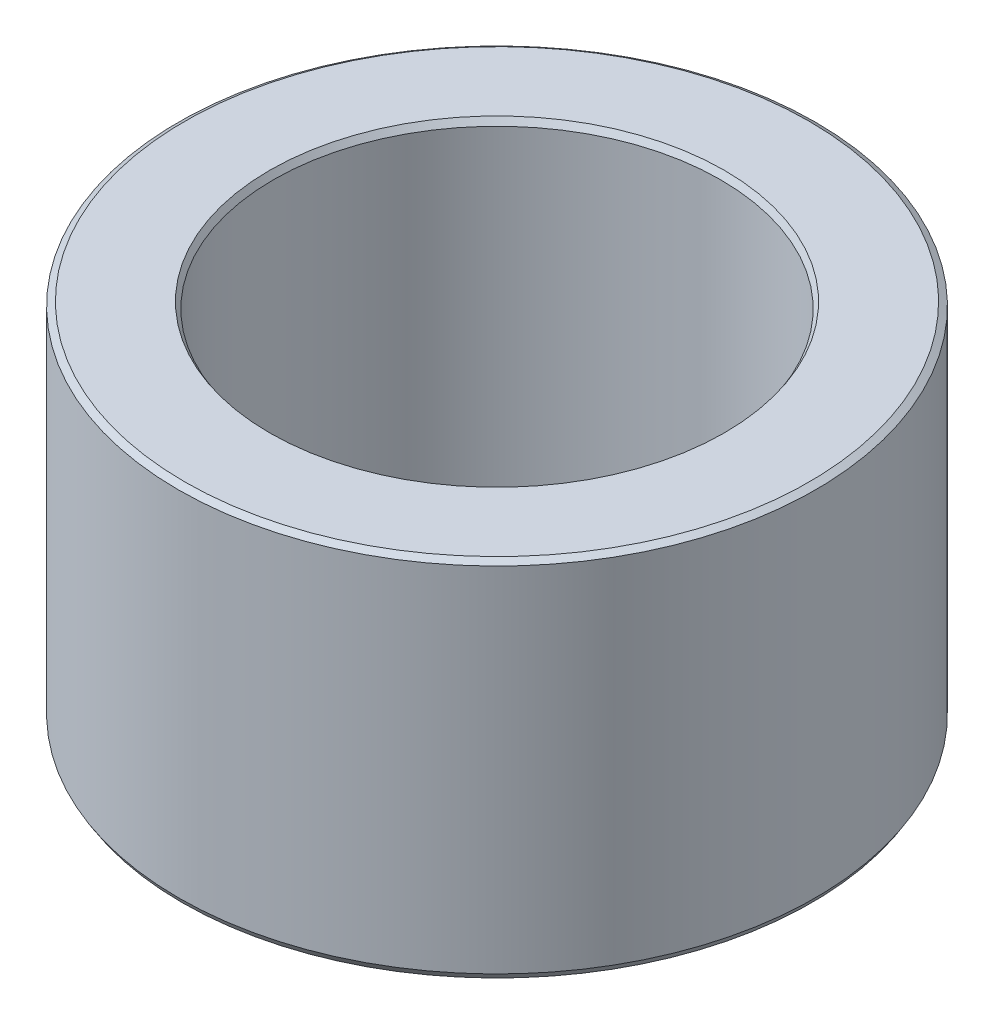
ISO-10303-21;
HEADER;
FILE_DESCRIPTION(('STEP AP214'),'2;1');
FILE_NAME('part.step','',(''),(''),'','','');
FILE_SCHEMA(('AUTOMOTIVE_DESIGN { 1 0 10303 214 1 1 1 1 }'));
ENDSEC;
DATA;
#1=APPLICATION_CONTEXT('core data for automotive mechanical design processes');
#2=APPLICATION_PROTOCOL_DEFINITION('international standard','automotive_design',2000,#1);
#3=PRODUCT_CONTEXT('',#1,'mechanical');
#4=PRODUCT('Part','Part','',(#3));
#5=PRODUCT_RELATED_PRODUCT_CATEGORY('part','',(#4));
#6=PRODUCT_DEFINITION_FORMATION('','',#4);
#7=PRODUCT_DEFINITION_CONTEXT('part definition',#1,'design');
#8=PRODUCT_DEFINITION('design','',#6,#7);
#9=PRODUCT_DEFINITION_SHAPE('','',#8);
#10=(LENGTH_UNIT() NAMED_UNIT(*) SI_UNIT(.MILLI.,.METRE.));
#11=(NAMED_UNIT(*) PLANE_ANGLE_UNIT() SI_UNIT($,.RADIAN.));
#12=(NAMED_UNIT(*) SI_UNIT($,.STERADIAN.) SOLID_ANGLE_UNIT());
#13=UNCERTAINTY_MEASURE_WITH_UNIT(LENGTH_MEASURE(1.E-05),#10,'distance_accuracy_value','');
#14=(GEOMETRIC_REPRESENTATION_CONTEXT(3) GLOBAL_UNCERTAINTY_ASSIGNED_CONTEXT((#13)) GLOBAL_UNIT_ASSIGNED_CONTEXT((#10,
#11,#12)) REPRESENTATION_CONTEXT('',''));
#15=CARTESIAN_POINT('',(0.,0.,0.));
#16=DIRECTION('',(0.,0.,1.));
#17=DIRECTION('',(1.,0.,0.));
#18=AXIS2_PLACEMENT_3D('',#15,#16,#17);
#19=CARTESIAN_POINT('',(0.,59.8847623152872,0.));
#20=DIRECTION('',(0.,-1.,0.));
#21=DIRECTION('',(0.,0.,-1.));
#22=AXIS2_PLACEMENT_3D('',#19,#20,#21);
#23=CYLINDRICAL_SURFACE('',#22,52.5);
#24=CARTESIAN_POINT('',(0.,1.02538390258704,0.));
#25=DIRECTION('',(0.,1.,0.));
#26=DIRECTION('',(0.,0.,1.));
#27=AXIS2_PLACEMENT_3D('',#24,#25,#26);
#28=CIRCLE('',#27,52.5);
#29=CARTESIAN_POINT('',(0.,1.02538390258704,52.5));
#30=VERTEX_POINT('',#29);
#31=EDGE_CURVE('E10',#30,#30,#28,.T.);
#32=ORIENTED_EDGE('',*,*,#31,.T.);
#33=EDGE_LOOP('',(#32));
#34=FACE_BOUND('',#33,.T.);
#35=CARTESIAN_POINT('',(0.,59.2539404244443,0.));
#36=DIRECTION('',(0.,1.,0.));
#37=DIRECTION('',(0.,0.,1.));
#38=AXIS2_PLACEMENT_3D('',#35,#36,#37);
#39=CIRCLE('',#38,52.5);
#40=CARTESIAN_POINT('',(0.,59.2539404244443,52.5));
#41=VERTEX_POINT('',#40);
#42=EDGE_CURVE('E50',#41,#41,#39,.F.);
#43=ORIENTED_EDGE('',*,*,#42,.T.);
#44=EDGE_LOOP('',(#43));
#45=FACE_BOUND('',#44,.T.);
#46=ADVANCED_FACE('F39',(#34,#45),#23,.T.);
#47=CARTESIAN_POINT('',(0.,59.8847623152872,0.));
#48=DIRECTION('',(0.,1.,0.));
#49=DIRECTION('',(0.,0.,1.));
#50=AXIS2_PLACEMENT_3D('',#47,#48,#49);
#51=PLANE('',#50);
#52=CARTESIAN_POINT('',(0.,59.8847623152872,0.));
#53=DIRECTION('',(0.,1.,0.));
#54=DIRECTION('',(0.,0.,1.));
#55=AXIS2_PLACEMENT_3D('',#52,#53,#54);
#56=CIRCLE('',#55,37.4832103646469);
#57=CARTESIAN_POINT('',(0.,59.8847623152872,37.4832103646469));
#58=VERTEX_POINT('',#57);
#59=EDGE_CURVE('E58',#58,#58,#56,.F.);
#60=ORIENTED_EDGE('',*,*,#59,.T.);
#61=EDGE_LOOP('',(#60));
#62=FACE_BOUND('',#61,.T.);
#63=CARTESIAN_POINT('',(0.,59.8847623152872,0.));
#64=DIRECTION('',(0.,1.,0.));
#65=DIRECTION('',(0.,0.,1.));
#66=AXIS2_PLACEMENT_3D('',#63,#64,#65);
#67=CIRCLE('',#66,51.474616097413);
#68=CARTESIAN_POINT('',(0.,59.8847623152872,51.474616097413));
#69=VERTEX_POINT('',#68);
#70=EDGE_CURVE('E61',#69,#69,#67,.T.);
#71=ORIENTED_EDGE('',*,*,#70,.T.);
#72=EDGE_LOOP('',(#71));
#73=FACE_BOUND('',#72,.T.);
#74=ADVANCED_FACE('F88',(#62,#73),#51,.T.);
#75=CARTESIAN_POINT('',(0.,0.,0.));
#76=DIRECTION('',(0.,1.,0.));
#77=DIRECTION('',(0.,0.,1.));
#78=AXIS2_PLACEMENT_3D('',#75,#76,#77);
#79=PLANE('',#78);
#80=CARTESIAN_POINT('',(0.,0.,0.));
#81=DIRECTION('',(0.,1.,0.));
#82=DIRECTION('',(0.,0.,1.));
#83=AXIS2_PLACEMENT_3D('',#80,#81,#82);
#84=CIRCLE('',#83,37.877772376391);
#85=CARTESIAN_POINT('',(0.,0.,37.877772376391));
#86=VERTEX_POINT('',#85);
#87=EDGE_CURVE('E51',#86,#86,#84,.T.);
#88=ORIENTED_EDGE('',*,*,#87,.T.);
#89=EDGE_LOOP('',(#88));
#90=FACE_BOUND('',#89,.T.);
#91=CARTESIAN_POINT('',(0.,0.,0.));
#92=DIRECTION('',(0.,1.,0.));
#93=DIRECTION('',(0.,0.,1.));
#94=AXIS2_PLACEMENT_3D('',#91,#92,#93);
#95=CIRCLE('',#94,51.8691781091571);
#96=CARTESIAN_POINT('',(0.,0.,51.8691781091571));
#97=VERTEX_POINT('',#96);
#98=EDGE_CURVE('E54',#97,#97,#95,.F.);
#99=ORIENTED_EDGE('',*,*,#98,.T.);
#100=EDGE_LOOP('',(#99));
#101=FACE_BOUND('',#100,.T.);
#102=ADVANCED_FACE('F83',(#90,#101),#79,.F.);
#103=CARTESIAN_POINT('',(0.,59.8847623152872,0.));
#104=DIRECTION('',(0.,-1.,0.));
#105=DIRECTION('',(0.,0.,-1.));
#106=AXIS2_PLACEMENT_3D('',#103,#104,#105);
#107=CYLINDRICAL_SURFACE('',#106,36.8523884738039);
#108=CARTESIAN_POINT('',(0.,58.8593784127002,0.));
#109=DIRECTION('',(0.,1.,0.));
#110=DIRECTION('',(0.,0.,1.));
#111=AXIS2_PLACEMENT_3D('',#108,#109,#110);
#112=CIRCLE('',#111,36.8523884738039);
#113=CARTESIAN_POINT('',(0.,58.8593784127002,36.8523884738039));
#114=VERTEX_POINT('',#113);
#115=EDGE_CURVE('E67',#114,#114,#112,.T.);
#116=ORIENTED_EDGE('',*,*,#115,.T.);
#117=EDGE_LOOP('',(#116));
#118=FACE_BOUND('',#117,.T.);
#119=CARTESIAN_POINT('',(0.,0.63082189084291,0.));
#120=DIRECTION('',(0.,1.,0.));
#121=DIRECTION('',(0.,0.,1.));
#122=AXIS2_PLACEMENT_3D('',#119,#120,#121);
#123=CIRCLE('',#122,36.8523884738039);
#124=CARTESIAN_POINT('',(0.,0.63082189084291,36.8523884738039));
#125=VERTEX_POINT('',#124);
#126=EDGE_CURVE('E69',#125,#125,#123,.F.);
#127=ORIENTED_EDGE('',*,*,#126,.T.);
#128=EDGE_LOOP('',(#127));
#129=FACE_BOUND('',#128,.T.);
#130=ADVANCED_FACE('F71',(#118,#129),#107,.F.);
#131=CARTESIAN_POINT('',(0.,58.8593784127002,0.));
#132=DIRECTION('',(0.,1.,0.));
#133=DIRECTION('',(0.,0.,1.));
#134=AXIS2_PLACEMENT_3D('',#131,#132,#133);
#135=CONICAL_SURFACE('',#134,36.8523884738039,0.551525108440911);
#136=ORIENTED_EDGE('',*,*,#59,.F.);
#137=EDGE_LOOP('',(#136));
#138=FACE_BOUND('',#137,.T.);
#139=ORIENTED_EDGE('',*,*,#115,.F.);
#140=EDGE_LOOP('',(#139));
#141=FACE_BOUND('',#140,.T.);
#142=ADVANCED_FACE('F77',(#138,#141),#135,.F.);
#143=CARTESIAN_POINT('',(0.,0.,0.));
#144=DIRECTION('',(0.,-1.,0.));
#145=DIRECTION('',(0.,0.,-1.));
#146=AXIS2_PLACEMENT_3D('',#143,#144,#145);
#147=CONICAL_SURFACE('',#146,37.877772376391,1.01927121835399);
#148=ORIENTED_EDGE('',*,*,#126,.F.);
#149=EDGE_LOOP('',(#148));
#150=FACE_BOUND('',#149,.T.);
#151=ORIENTED_EDGE('',*,*,#87,.F.);
#152=EDGE_LOOP('',(#151));
#153=FACE_BOUND('',#152,.T.);
#154=ADVANCED_FACE('F73',(#150,#153),#147,.F.);
#155=CARTESIAN_POINT('',(0.,1.02538390258704,0.));
#156=DIRECTION('',(0.,1.,0.));
#157=DIRECTION('',(0.,0.,1.));
#158=AXIS2_PLACEMENT_3D('',#155,#156,#157);
#159=CONICAL_SURFACE('',#158,52.5,0.551525108440913);
#160=ORIENTED_EDGE('',*,*,#98,.F.);
#161=EDGE_LOOP('',(#160));
#162=FACE_BOUND('',#161,.T.);
#163=ORIENTED_EDGE('',*,*,#31,.F.);
#164=EDGE_LOOP('',(#163));
#165=FACE_BOUND('',#164,.T.);
#166=ADVANCED_FACE('F76',(#162,#165),#159,.T.);
#167=CARTESIAN_POINT('',(0.,59.8847623152872,0.));
#168=DIRECTION('',(0.,-1.,0.));
#169=DIRECTION('',(0.,0.,-1.));
#170=AXIS2_PLACEMENT_3D('',#167,#168,#169);
#171=CONICAL_SURFACE('',#170,51.474616097413,1.01927121835399);
#172=ORIENTED_EDGE('',*,*,#42,.F.);
#173=EDGE_LOOP('',(#172));
#174=FACE_BOUND('',#173,.T.);
#175=ORIENTED_EDGE('',*,*,#70,.F.);
#176=EDGE_LOOP('',(#175));
#177=FACE_BOUND('',#176,.T.);
#178=ADVANCED_FACE('F45',(#174,#177),#171,.T.);
#179=CLOSED_SHELL('',(#46,#74,#102,#130,#142,#154,#166,#178));
#180=MANIFOLD_SOLID_BREP('B2',#179);
#181=ADVANCED_BREP_SHAPE_REPRESENTATION('',(#18,#180),#14);
#182=SHAPE_DEFINITION_REPRESENTATION(#9,#181);
ENDSEC;
END-ISO-10303-21;
